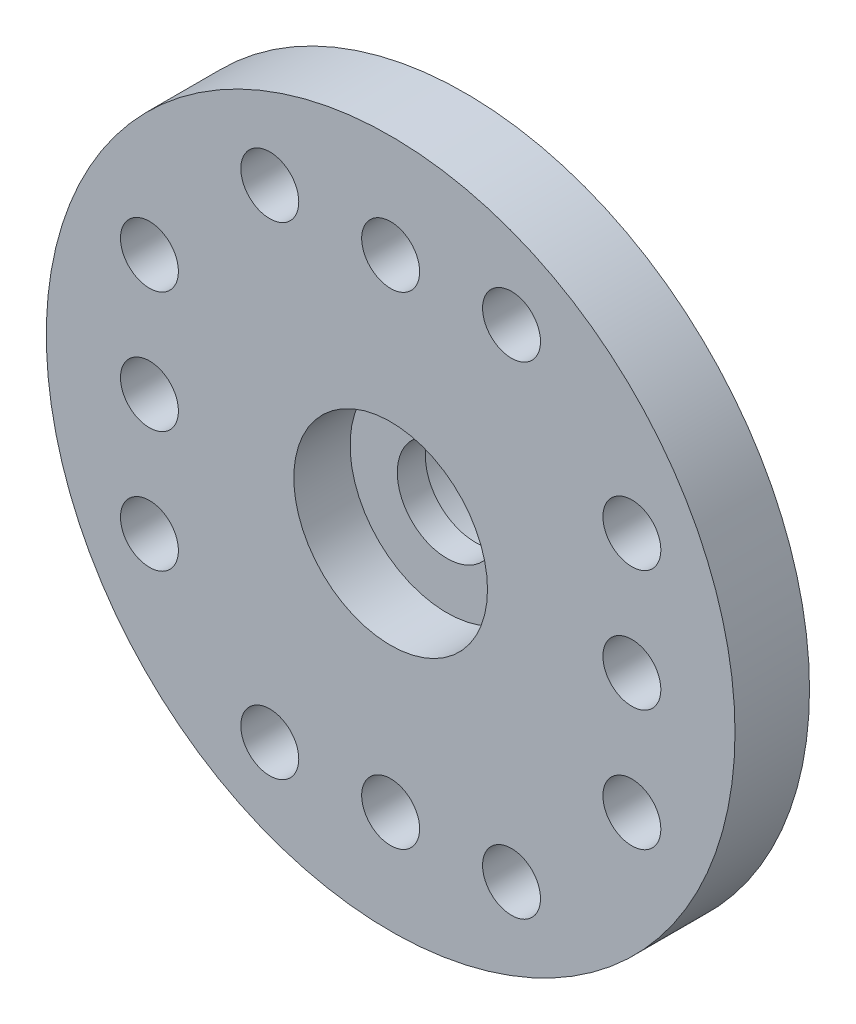
ISO-10303-21;
HEADER;
FILE_DESCRIPTION(('STEP AP214'),'2;1');
FILE_NAME('part.step','',(''),(''),'','','');
FILE_SCHEMA(('AUTOMOTIVE_DESIGN { 1 0 10303 214 1 1 1 1 }'));
ENDSEC;
DATA;
#1=APPLICATION_CONTEXT('core data for automotive mechanical design processes');
#2=APPLICATION_PROTOCOL_DEFINITION('international standard','automotive_design',2000,#1);
#3=PRODUCT_CONTEXT('',#1,'mechanical');
#4=PRODUCT('Part','Part','',(#3));
#5=PRODUCT_RELATED_PRODUCT_CATEGORY('part','',(#4));
#6=PRODUCT_DEFINITION_FORMATION('','',#4);
#7=PRODUCT_DEFINITION_CONTEXT('part definition',#1,'design');
#8=PRODUCT_DEFINITION('design','',#6,#7);
#9=PRODUCT_DEFINITION_SHAPE('','',#8);
#10=(LENGTH_UNIT() NAMED_UNIT(*) SI_UNIT(.MILLI.,.METRE.));
#11=(NAMED_UNIT(*) PLANE_ANGLE_UNIT() SI_UNIT($,.RADIAN.));
#12=(NAMED_UNIT(*) SI_UNIT($,.STERADIAN.) SOLID_ANGLE_UNIT());
#13=UNCERTAINTY_MEASURE_WITH_UNIT(LENGTH_MEASURE(1.E-05),#10,'distance_accuracy_value','');
#14=(GEOMETRIC_REPRESENTATION_CONTEXT(3) GLOBAL_UNCERTAINTY_ASSIGNED_CONTEXT((#13)) GLOBAL_UNIT_ASSIGNED_CONTEXT((#10,
#11,#12)) REPRESENTATION_CONTEXT('',''));
#15=CARTESIAN_POINT('',(0.,0.,0.));
#16=DIRECTION('',(0.,0.,1.));
#17=DIRECTION('',(1.,0.,0.));
#18=AXIS2_PLACEMENT_3D('',#15,#16,#17);
#19=CARTESIAN_POINT('',(9.62,10.,-7.54264068711929));
#20=DIRECTION('',(0.,0.,1.));
#21=DIRECTION('',(1.,0.,0.));
#22=AXIS2_PLACEMENT_3D('',#19,#20,#21);
#23=CYLINDRICAL_SURFACE('',#22,1.5);
#24=CARTESIAN_POINT('',(9.62,10.,0.55));
#25=DIRECTION('',(0.,0.,1.));
#26=DIRECTION('',(1.,0.,0.));
#27=AXIS2_PLACEMENT_3D('',#24,#25,#26);
#28=CIRCLE('',#27,1.5);
#29=CARTESIAN_POINT('',(11.12,10.,0.55));
#30=VERTEX_POINT('',#29);
#31=EDGE_CURVE('E91',#30,#30,#28,.F.);
#32=ORIENTED_EDGE('',*,*,#31,.F.);
#33=EDGE_LOOP('',(#32));
#34=FACE_BOUND('',#33,.T.);
#35=CARTESIAN_POINT('',(9.62,10.,-0.3));
#36=DIRECTION('',(0.,0.,-1.));
#37=DIRECTION('',(-1.,0.,0.));
#38=AXIS2_PLACEMENT_3D('',#35,#36,#37);
#39=CIRCLE('',#38,1.5);
#40=CARTESIAN_POINT('',(8.12,10.,-0.3));
#41=VERTEX_POINT('',#40);
#42=EDGE_CURVE('E38',#41,#41,#39,.F.);
#43=ORIENTED_EDGE('',*,*,#42,.F.);
#44=EDGE_LOOP('',(#43));
#45=FACE_BOUND('',#44,.T.);
#46=ADVANCED_FACE('F34',(#34,#45),#23,.F.);
#47=CARTESIAN_POINT('',(9.62,10.,2.25));
#48=DIRECTION('',(0.,0.,-1.));
#49=DIRECTION('',(-1.,0.,0.));
#50=AXIS2_PLACEMENT_3D('',#47,#48,#49);
#51=CYLINDRICAL_SURFACE('',#50,10.4);
#52=CARTESIAN_POINT('',(9.62,10.,2.25));
#53=DIRECTION('',(0.,0.,1.));
#54=DIRECTION('',(1.,0.,0.));
#55=AXIS2_PLACEMENT_3D('',#52,#53,#54);
#56=CIRCLE('',#55,10.4);
#57=CARTESIAN_POINT('',(20.02,10.,2.25));
#58=VERTEX_POINT('',#57);
#59=EDGE_CURVE('E42',#58,#58,#56,.T.);
#60=ORIENTED_EDGE('',*,*,#59,.F.);
#61=EDGE_LOOP('',(#60));
#62=FACE_BOUND('',#61,.T.);
#63=CARTESIAN_POINT('',(9.62,10.,0.));
#64=DIRECTION('',(0.,0.,1.));
#65=DIRECTION('',(1.,0.,0.));
#66=AXIS2_PLACEMENT_3D('',#63,#64,#65);
#67=CIRCLE('',#66,10.4);
#68=CARTESIAN_POINT('',(20.02,10.,0.));
#69=VERTEX_POINT('',#68);
#70=EDGE_CURVE('E47',#69,#69,#67,.T.);
#71=ORIENTED_EDGE('',*,*,#70,.T.);
#72=EDGE_LOOP('',(#71));
#73=FACE_BOUND('',#72,.T.);
#74=ADVANCED_FACE('F36',(#62,#73),#51,.T.);
#75=CARTESIAN_POINT('',(9.62,10.,2.25));
#76=DIRECTION('',(0.,0.,1.));
#77=DIRECTION('',(1.,0.,0.));
#78=AXIS2_PLACEMENT_3D('',#75,#76,#77);
#79=PLANE('',#78);
#80=CARTESIAN_POINT('',(9.62,10.,2.25));
#81=DIRECTION('',(0.,0.,1.));
#82=DIRECTION('',(1.,0.,0.));
#83=AXIS2_PLACEMENT_3D('',#80,#81,#82);
#84=CIRCLE('',#83,2.925);
#85=CARTESIAN_POINT('',(12.545,10.,2.25));
#86=VERTEX_POINT('',#85);
#87=EDGE_CURVE('E101',#86,#86,#84,.T.);
#88=ORIENTED_EDGE('',*,*,#87,.F.);
#89=EDGE_LOOP('',(#88));
#90=FACE_BOUND('',#89,.T.);
#91=CARTESIAN_POINT('',(13.27,17.285,2.25));
#92=DIRECTION('',(0.,0.,1.));
#93=DIRECTION('',(1.,0.,0.));
#94=AXIS2_PLACEMENT_3D('',#91,#92,#93);
#95=CIRCLE('',#94,0.875);
#96=CARTESIAN_POINT('',(14.145,17.285,2.25));
#97=VERTEX_POINT('',#96);
#98=EDGE_CURVE('E117',#97,#97,#95,.T.);
#99=ORIENTED_EDGE('',*,*,#98,.F.);
#100=EDGE_LOOP('',(#99));
#101=FACE_BOUND('',#100,.T.);
#102=CARTESIAN_POINT('',(9.62,17.285,2.25));
#103=DIRECTION('',(0.,0.,1.));
#104=DIRECTION('',(1.,0.,0.));
#105=AXIS2_PLACEMENT_3D('',#102,#103,#104);
#106=CIRCLE('',#105,0.875);
#107=CARTESIAN_POINT('',(10.495,17.285,2.25));
#108=VERTEX_POINT('',#107);
#109=EDGE_CURVE('E127',#108,#108,#106,.T.);
#110=ORIENTED_EDGE('',*,*,#109,.F.);
#111=EDGE_LOOP('',(#110));
#112=FACE_BOUND('',#111,.T.);
#113=CARTESIAN_POINT('',(2.335,6.35,2.25));
#114=DIRECTION('',(0.,0.,1.));
#115=DIRECTION('',(1.,0.,0.));
#116=AXIS2_PLACEMENT_3D('',#113,#114,#115);
#117=CIRCLE('',#116,0.875000000000001);
#118=CARTESIAN_POINT('',(3.21,6.35,2.25));
#119=VERTEX_POINT('',#118);
#120=EDGE_CURVE('E124',#119,#119,#117,.T.);
#121=ORIENTED_EDGE('',*,*,#120,.F.);
#122=EDGE_LOOP('',(#121));
#123=FACE_BOUND('',#122,.T.);
#124=CARTESIAN_POINT('',(2.335,13.65,2.25));
#125=DIRECTION('',(0.,0.,1.));
#126=DIRECTION('',(1.,0.,0.));
#127=AXIS2_PLACEMENT_3D('',#124,#125,#126);
#128=CIRCLE('',#127,0.874999999999998);
#129=CARTESIAN_POINT('',(3.21,13.65,2.25));
#130=VERTEX_POINT('',#129);
#131=EDGE_CURVE('E120',#130,#130,#128,.T.);
#132=ORIENTED_EDGE('',*,*,#131,.F.);
#133=EDGE_LOOP('',(#132));
#134=FACE_BOUND('',#133,.T.);
#135=CARTESIAN_POINT('',(9.62,2.715,2.25));
#136=DIRECTION('',(0.,0.,1.));
#137=DIRECTION('',(1.,0.,0.));
#138=AXIS2_PLACEMENT_3D('',#135,#136,#137);
#139=CIRCLE('',#138,0.875);
#140=CARTESIAN_POINT('',(10.495,2.715,2.25));
#141=VERTEX_POINT('',#140);
#142=EDGE_CURVE('E59',#141,#141,#139,.T.);
#143=ORIENTED_EDGE('',*,*,#142,.F.);
#144=EDGE_LOOP('',(#143));
#145=FACE_BOUND('',#144,.T.);
#146=CARTESIAN_POINT('',(5.97,2.715,2.25));
#147=DIRECTION('',(0.,0.,1.));
#148=DIRECTION('',(1.,0.,0.));
#149=AXIS2_PLACEMENT_3D('',#146,#147,#148);
#150=CIRCLE('',#149,0.875);
#151=CARTESIAN_POINT('',(6.845,2.715,2.25));
#152=VERTEX_POINT('',#151);
#153=EDGE_CURVE('E135',#152,#152,#150,.T.);
#154=ORIENTED_EDGE('',*,*,#153,.F.);
#155=EDGE_LOOP('',(#154));
#156=FACE_BOUND('',#155,.T.);
#157=CARTESIAN_POINT('',(13.27,2.715,2.25));
#158=DIRECTION('',(0.,0.,1.));
#159=DIRECTION('',(1.,0.,0.));
#160=AXIS2_PLACEMENT_3D('',#157,#158,#159);
#161=CIRCLE('',#160,0.875);
#162=CARTESIAN_POINT('',(14.145,2.715,2.25));
#163=VERTEX_POINT('',#162);
#164=EDGE_CURVE('E132',#163,#163,#161,.T.);
#165=ORIENTED_EDGE('',*,*,#164,.F.);
#166=EDGE_LOOP('',(#165));
#167=FACE_BOUND('',#166,.T.);
#168=CARTESIAN_POINT('',(2.335,10.,2.25));
#169=DIRECTION('',(0.,0.,1.));
#170=DIRECTION('',(1.,0.,0.));
#171=AXIS2_PLACEMENT_3D('',#168,#169,#170);
#172=CIRCLE('',#171,0.875000000000001);
#173=CARTESIAN_POINT('',(3.21,10.,2.25));
#174=VERTEX_POINT('',#173);
#175=EDGE_CURVE('E123',#174,#174,#172,.T.);
#176=ORIENTED_EDGE('',*,*,#175,.F.);
#177=EDGE_LOOP('',(#176));
#178=FACE_BOUND('',#177,.T.);
#179=CARTESIAN_POINT('',(16.905,13.65,2.25));
#180=DIRECTION('',(0.,0.,1.));
#181=DIRECTION('',(1.,0.,0.));
#182=AXIS2_PLACEMENT_3D('',#179,#180,#181);
#183=CIRCLE('',#182,0.875000000000002);
#184=CARTESIAN_POINT('',(17.78,13.65,2.25));
#185=VERTEX_POINT('',#184);
#186=EDGE_CURVE('E93',#185,#185,#183,.T.);
#187=ORIENTED_EDGE('',*,*,#186,.F.);
#188=EDGE_LOOP('',(#187));
#189=FACE_BOUND('',#188,.T.);
#190=CARTESIAN_POINT('',(16.905,6.35,2.25));
#191=DIRECTION('',(0.,0.,1.));
#192=DIRECTION('',(1.,0.,0.));
#193=AXIS2_PLACEMENT_3D('',#190,#191,#192);
#194=CIRCLE('',#193,0.875000000000002);
#195=CARTESIAN_POINT('',(17.78,6.35,2.25));
#196=VERTEX_POINT('',#195);
#197=EDGE_CURVE('E98',#196,#196,#194,.T.);
#198=ORIENTED_EDGE('',*,*,#197,.F.);
#199=EDGE_LOOP('',(#198));
#200=FACE_BOUND('',#199,.T.);
#201=CARTESIAN_POINT('',(16.905,10.,2.25));
#202=DIRECTION('',(0.,0.,1.));
#203=DIRECTION('',(1.,0.,0.));
#204=AXIS2_PLACEMENT_3D('',#201,#202,#203);
#205=CIRCLE('',#204,0.875000000000002);
#206=CARTESIAN_POINT('',(17.78,10.,2.25));
#207=VERTEX_POINT('',#206);
#208=EDGE_CURVE('E112',#207,#207,#205,.T.);
#209=ORIENTED_EDGE('',*,*,#208,.F.);
#210=EDGE_LOOP('',(#209));
#211=FACE_BOUND('',#210,.T.);
#212=CARTESIAN_POINT('',(5.97,17.285,2.25));
#213=DIRECTION('',(0.,0.,1.));
#214=DIRECTION('',(1.,0.,0.));
#215=AXIS2_PLACEMENT_3D('',#212,#213,#214);
#216=CIRCLE('',#215,0.875);
#217=CARTESIAN_POINT('',(6.845,17.285,2.25));
#218=VERTEX_POINT('',#217);
#219=EDGE_CURVE('E114',#218,#218,#216,.T.);
#220=ORIENTED_EDGE('',*,*,#219,.F.);
#221=EDGE_LOOP('',(#220));
#222=FACE_BOUND('',#221,.T.);
#223=ORIENTED_EDGE('',*,*,#59,.T.);
#224=EDGE_LOOP('',(#223));
#225=FACE_BOUND('',#224,.T.);
#226=ADVANCED_FACE('F145',(#90,#101,#112,#123,#134,#145,#156,#167,#178,#189,#200,#211,#222,
#225),#79,.T.);
#227=CARTESIAN_POINT('',(9.62,10.,0.));
#228=DIRECTION('',(0.,0.,1.));
#229=DIRECTION('',(1.,0.,0.));
#230=AXIS2_PLACEMENT_3D('',#227,#228,#229);
#231=PLANE('',#230);
#232=CARTESIAN_POINT('',(13.27,17.285,0.));
#233=DIRECTION('',(0.,0.,1.));
#234=DIRECTION('',(1.,0.,0.));
#235=AXIS2_PLACEMENT_3D('',#232,#233,#234);
#236=CIRCLE('',#235,0.875);
#237=CARTESIAN_POINT('',(14.145,17.285,0.));
#238=VERTEX_POINT('',#237);
#239=EDGE_CURVE('E89',#238,#238,#236,.T.);
#240=ORIENTED_EDGE('',*,*,#239,.T.);
#241=EDGE_LOOP('',(#240));
#242=FACE_BOUND('',#241,.T.);
#243=CARTESIAN_POINT('',(9.62,17.285,0.));
#244=DIRECTION('',(0.,0.,1.));
#245=DIRECTION('',(1.,0.,0.));
#246=AXIS2_PLACEMENT_3D('',#243,#244,#245);
#247=CIRCLE('',#246,0.875);
#248=CARTESIAN_POINT('',(10.495,17.285,0.));
#249=VERTEX_POINT('',#248);
#250=EDGE_CURVE('E86',#249,#249,#247,.T.);
#251=ORIENTED_EDGE('',*,*,#250,.T.);
#252=EDGE_LOOP('',(#251));
#253=FACE_BOUND('',#252,.T.);
#254=CARTESIAN_POINT('',(2.335,6.35,0.));
#255=DIRECTION('',(0.,0.,1.));
#256=DIRECTION('',(1.,0.,0.));
#257=AXIS2_PLACEMENT_3D('',#254,#255,#256);
#258=CIRCLE('',#257,0.875000000000001);
#259=CARTESIAN_POINT('',(3.21,6.35,0.));
#260=VERTEX_POINT('',#259);
#261=EDGE_CURVE('E83',#260,#260,#258,.T.);
#262=ORIENTED_EDGE('',*,*,#261,.T.);
#263=EDGE_LOOP('',(#262));
#264=FACE_BOUND('',#263,.T.);
#265=CARTESIAN_POINT('',(2.335,13.65,0.));
#266=DIRECTION('',(0.,0.,1.));
#267=DIRECTION('',(1.,0.,0.));
#268=AXIS2_PLACEMENT_3D('',#265,#266,#267);
#269=CIRCLE('',#268,0.874999999999998);
#270=CARTESIAN_POINT('',(3.21,13.65,0.));
#271=VERTEX_POINT('',#270);
#272=EDGE_CURVE('E80',#271,#271,#269,.T.);
#273=ORIENTED_EDGE('',*,*,#272,.T.);
#274=EDGE_LOOP('',(#273));
#275=FACE_BOUND('',#274,.T.);
#276=CARTESIAN_POINT('',(9.62,2.715,0.));
#277=DIRECTION('',(0.,0.,1.));
#278=DIRECTION('',(1.,0.,0.));
#279=AXIS2_PLACEMENT_3D('',#276,#277,#278);
#280=CIRCLE('',#279,0.875);
#281=CARTESIAN_POINT('',(10.495,2.715,0.));
#282=VERTEX_POINT('',#281);
#283=EDGE_CURVE('E77',#282,#282,#280,.T.);
#284=ORIENTED_EDGE('',*,*,#283,.T.);
#285=EDGE_LOOP('',(#284));
#286=FACE_BOUND('',#285,.T.);
#287=CARTESIAN_POINT('',(5.97,2.715,0.));
#288=DIRECTION('',(0.,0.,1.));
#289=DIRECTION('',(1.,0.,0.));
#290=AXIS2_PLACEMENT_3D('',#287,#288,#289);
#291=CIRCLE('',#290,0.875);
#292=CARTESIAN_POINT('',(6.845,2.715,0.));
#293=VERTEX_POINT('',#292);
#294=EDGE_CURVE('E74',#293,#293,#291,.T.);
#295=ORIENTED_EDGE('',*,*,#294,.T.);
#296=EDGE_LOOP('',(#295));
#297=FACE_BOUND('',#296,.T.);
#298=CARTESIAN_POINT('',(13.27,2.715,0.));
#299=DIRECTION('',(0.,0.,1.));
#300=DIRECTION('',(1.,0.,0.));
#301=AXIS2_PLACEMENT_3D('',#298,#299,#300);
#302=CIRCLE('',#301,0.875);
#303=CARTESIAN_POINT('',(14.145,2.715,0.));
#304=VERTEX_POINT('',#303);
#305=EDGE_CURVE('E71',#304,#304,#302,.T.);
#306=ORIENTED_EDGE('',*,*,#305,.T.);
#307=EDGE_LOOP('',(#306));
#308=FACE_BOUND('',#307,.T.);
#309=CARTESIAN_POINT('',(2.335,10.,0.));
#310=DIRECTION('',(0.,0.,1.));
#311=DIRECTION('',(1.,0.,0.));
#312=AXIS2_PLACEMENT_3D('',#309,#310,#311);
#313=CIRCLE('',#312,0.875000000000001);
#314=CARTESIAN_POINT('',(3.21,10.,0.));
#315=VERTEX_POINT('',#314);
#316=EDGE_CURVE('E68',#315,#315,#313,.T.);
#317=ORIENTED_EDGE('',*,*,#316,.T.);
#318=EDGE_LOOP('',(#317));
#319=FACE_BOUND('',#318,.T.);
#320=CARTESIAN_POINT('',(16.905,13.65,0.));
#321=DIRECTION('',(0.,0.,1.));
#322=DIRECTION('',(1.,0.,0.));
#323=AXIS2_PLACEMENT_3D('',#320,#321,#322);
#324=CIRCLE('',#323,0.875000000000002);
#325=CARTESIAN_POINT('',(17.78,13.65,0.));
#326=VERTEX_POINT('',#325);
#327=EDGE_CURVE('E65',#326,#326,#324,.T.);
#328=ORIENTED_EDGE('',*,*,#327,.T.);
#329=EDGE_LOOP('',(#328));
#330=FACE_BOUND('',#329,.T.);
#331=CARTESIAN_POINT('',(16.905,6.35,0.));
#332=DIRECTION('',(0.,0.,1.));
#333=DIRECTION('',(1.,0.,0.));
#334=AXIS2_PLACEMENT_3D('',#331,#332,#333);
#335=CIRCLE('',#334,0.875000000000002);
#336=CARTESIAN_POINT('',(17.78,6.35,0.));
#337=VERTEX_POINT('',#336);
#338=EDGE_CURVE('E62',#337,#337,#335,.T.);
#339=ORIENTED_EDGE('',*,*,#338,.T.);
#340=EDGE_LOOP('',(#339));
#341=FACE_BOUND('',#340,.T.);
#342=CARTESIAN_POINT('',(16.905,10.,0.));
#343=DIRECTION('',(0.,0.,1.));
#344=DIRECTION('',(1.,0.,0.));
#345=AXIS2_PLACEMENT_3D('',#342,#343,#344);
#346=CIRCLE('',#345,0.875000000000002);
#347=CARTESIAN_POINT('',(17.78,10.,0.));
#348=VERTEX_POINT('',#347);
#349=EDGE_CURVE('E58',#348,#348,#346,.T.);
#350=ORIENTED_EDGE('',*,*,#349,.T.);
#351=EDGE_LOOP('',(#350));
#352=FACE_BOUND('',#351,.T.);
#353=CARTESIAN_POINT('',(5.97,17.285,0.));
#354=DIRECTION('',(0.,0.,1.));
#355=DIRECTION('',(1.,0.,0.));
#356=AXIS2_PLACEMENT_3D('',#353,#354,#355);
#357=CIRCLE('',#356,0.875);
#358=CARTESIAN_POINT('',(6.845,17.285,0.));
#359=VERTEX_POINT('',#358);
#360=EDGE_CURVE('E55',#359,#359,#357,.T.);
#361=ORIENTED_EDGE('',*,*,#360,.T.);
#362=EDGE_LOOP('',(#361));
#363=FACE_BOUND('',#362,.T.);
#364=CARTESIAN_POINT('',(9.62,10.,0.));
#365=DIRECTION('',(0.,0.,-1.));
#366=DIRECTION('',(-1.,0.,0.));
#367=AXIS2_PLACEMENT_3D('',#364,#365,#366);
#368=CIRCLE('',#367,4.4);
#369=CARTESIAN_POINT('',(5.22,10.,0.));
#370=VERTEX_POINT('',#369);
#371=EDGE_CURVE('E10',#370,#370,#368,.T.);
#372=ORIENTED_EDGE('',*,*,#371,.F.);
#373=EDGE_LOOP('',(#372));
#374=FACE_BOUND('',#373,.T.);
#375=ORIENTED_EDGE('',*,*,#70,.F.);
#376=EDGE_LOOP('',(#375));
#377=FACE_BOUND('',#376,.T.);
#378=ADVANCED_FACE('F148',(#242,#253,#264,#275,#286,#297,#308,#319,#330,#341,#352,#363,#374,
#377),#231,.F.);
#379=CARTESIAN_POINT('',(9.62,10.,-3.3));
#380=DIRECTION('',(0.,0.,1.));
#381=DIRECTION('',(1.,0.,0.));
#382=AXIS2_PLACEMENT_3D('',#379,#380,#381);
#383=CYLINDRICAL_SURFACE('',#382,4.4);
#384=CARTESIAN_POINT('',(9.62,10.,-3.3));
#385=DIRECTION('',(0.,0.,-1.));
#386=DIRECTION('',(-1.,0.,0.));
#387=AXIS2_PLACEMENT_3D('',#384,#385,#386);
#388=CIRCLE('',#387,4.4);
#389=CARTESIAN_POINT('',(5.22,10.,-3.3));
#390=VERTEX_POINT('',#389);
#391=EDGE_CURVE('E50',#390,#390,#388,.T.);
#392=ORIENTED_EDGE('',*,*,#391,.F.);
#393=EDGE_LOOP('',(#392));
#394=FACE_BOUND('',#393,.T.);
#395=ORIENTED_EDGE('',*,*,#371,.T.);
#396=EDGE_LOOP('',(#395));
#397=FACE_BOUND('',#396,.T.);
#398=ADVANCED_FACE('F170',(#394,#397),#383,.T.);
#399=CARTESIAN_POINT('',(9.62,10.,-3.3));
#400=DIRECTION('',(0.,0.,-1.));
#401=DIRECTION('',(-1.,0.,0.));
#402=AXIS2_PLACEMENT_3D('',#399,#400,#401);
#403=PLANE('',#402);
#404=CARTESIAN_POINT('',(9.62,10.,-3.3));
#405=DIRECTION('',(0.,0.,-1.));
#406=DIRECTION('',(-1.,0.,0.));
#407=AXIS2_PLACEMENT_3D('',#404,#405,#406);
#408=CIRCLE('',#407,2.95);
#409=CARTESIAN_POINT('',(6.67,10.,-3.3));
#410=VERTEX_POINT('',#409);
#411=EDGE_CURVE('E108',#410,#410,#408,.T.);
#412=ORIENTED_EDGE('',*,*,#411,.F.);
#413=EDGE_LOOP('',(#412));
#414=FACE_BOUND('',#413,.T.);
#415=ORIENTED_EDGE('',*,*,#391,.T.);
#416=EDGE_LOOP('',(#415));
#417=FACE_BOUND('',#416,.T.);
#418=ADVANCED_FACE('F175',(#414,#417),#403,.T.);
#419=CARTESIAN_POINT('',(5.97,17.285,-7.54264068711929));
#420=DIRECTION('',(0.,0.,1.));
#421=DIRECTION('',(1.,0.,0.));
#422=AXIS2_PLACEMENT_3D('',#419,#420,#421);
#423=CYLINDRICAL_SURFACE('',#422,0.875);
#424=ORIENTED_EDGE('',*,*,#219,.T.);
#425=EDGE_LOOP('',(#424));
#426=FACE_BOUND('',#425,.T.);
#427=ORIENTED_EDGE('',*,*,#360,.F.);
#428=EDGE_LOOP('',(#427));
#429=FACE_BOUND('',#428,.T.);
#430=ADVANCED_FACE('F189',(#426,#429),#423,.F.);
#431=CARTESIAN_POINT('',(16.905,10.,-7.54264068711929));
#432=DIRECTION('',(0.,0.,1.));
#433=DIRECTION('',(1.,0.,0.));
#434=AXIS2_PLACEMENT_3D('',#431,#432,#433);
#435=CYLINDRICAL_SURFACE('',#434,0.875000000000002);
#436=ORIENTED_EDGE('',*,*,#208,.T.);
#437=EDGE_LOOP('',(#436));
#438=FACE_BOUND('',#437,.T.);
#439=ORIENTED_EDGE('',*,*,#349,.F.);
#440=EDGE_LOOP('',(#439));
#441=FACE_BOUND('',#440,.T.);
#442=ADVANCED_FACE('F194',(#438,#441),#435,.F.);
#443=CARTESIAN_POINT('',(16.905,6.35,-7.54264068711929));
#444=DIRECTION('',(0.,0.,1.));
#445=DIRECTION('',(1.,0.,0.));
#446=AXIS2_PLACEMENT_3D('',#443,#444,#445);
#447=CYLINDRICAL_SURFACE('',#446,0.875000000000002);
#448=ORIENTED_EDGE('',*,*,#197,.T.);
#449=EDGE_LOOP('',(#448));
#450=FACE_BOUND('',#449,.T.);
#451=ORIENTED_EDGE('',*,*,#338,.F.);
#452=EDGE_LOOP('',(#451));
#453=FACE_BOUND('',#452,.T.);
#454=ADVANCED_FACE('F228',(#450,#453),#447,.F.);
#455=CARTESIAN_POINT('',(16.905,13.65,-7.54264068711929));
#456=DIRECTION('',(0.,0.,1.));
#457=DIRECTION('',(1.,0.,0.));
#458=AXIS2_PLACEMENT_3D('',#455,#456,#457);
#459=CYLINDRICAL_SURFACE('',#458,0.875000000000002);
#460=ORIENTED_EDGE('',*,*,#186,.T.);
#461=EDGE_LOOP('',(#460));
#462=FACE_BOUND('',#461,.T.);
#463=ORIENTED_EDGE('',*,*,#327,.F.);
#464=EDGE_LOOP('',(#463));
#465=FACE_BOUND('',#464,.T.);
#466=ADVANCED_FACE('F231',(#462,#465),#459,.F.);
#467=CARTESIAN_POINT('',(2.335,10.,-7.54264068711929));
#468=DIRECTION('',(0.,0.,1.));
#469=DIRECTION('',(1.,0.,0.));
#470=AXIS2_PLACEMENT_3D('',#467,#468,#469);
#471=CYLINDRICAL_SURFACE('',#470,0.875000000000001);
#472=ORIENTED_EDGE('',*,*,#175,.T.);
#473=EDGE_LOOP('',(#472));
#474=FACE_BOUND('',#473,.T.);
#475=ORIENTED_EDGE('',*,*,#316,.F.);
#476=EDGE_LOOP('',(#475));
#477=FACE_BOUND('',#476,.T.);
#478=ADVANCED_FACE('F234',(#474,#477),#471,.F.);
#479=CARTESIAN_POINT('',(13.27,2.715,-7.54264068711929));
#480=DIRECTION('',(0.,0.,1.));
#481=DIRECTION('',(1.,0.,0.));
#482=AXIS2_PLACEMENT_3D('',#479,#480,#481);
#483=CYLINDRICAL_SURFACE('',#482,0.875);
#484=ORIENTED_EDGE('',*,*,#164,.T.);
#485=EDGE_LOOP('',(#484));
#486=FACE_BOUND('',#485,.T.);
#487=ORIENTED_EDGE('',*,*,#305,.F.);
#488=EDGE_LOOP('',(#487));
#489=FACE_BOUND('',#488,.T.);
#490=ADVANCED_FACE('F256',(#486,#489),#483,.F.);
#491=CARTESIAN_POINT('',(5.97,2.715,-7.54264068711929));
#492=DIRECTION('',(0.,0.,1.));
#493=DIRECTION('',(1.,0.,0.));
#494=AXIS2_PLACEMENT_3D('',#491,#492,#493);
#495=CYLINDRICAL_SURFACE('',#494,0.875);
#496=ORIENTED_EDGE('',*,*,#153,.T.);
#497=EDGE_LOOP('',(#496));
#498=FACE_BOUND('',#497,.T.);
#499=ORIENTED_EDGE('',*,*,#294,.F.);
#500=EDGE_LOOP('',(#499));
#501=FACE_BOUND('',#500,.T.);
#502=ADVANCED_FACE('F142',(#498,#501),#495,.F.);
#503=CARTESIAN_POINT('',(9.62,2.715,-7.54264068711929));
#504=DIRECTION('',(0.,0.,1.));
#505=DIRECTION('',(1.,0.,0.));
#506=AXIS2_PLACEMENT_3D('',#503,#504,#505);
#507=CYLINDRICAL_SURFACE('',#506,0.875);
#508=ORIENTED_EDGE('',*,*,#142,.T.);
#509=EDGE_LOOP('',(#508));
#510=FACE_BOUND('',#509,.T.);
#511=ORIENTED_EDGE('',*,*,#283,.F.);
#512=EDGE_LOOP('',(#511));
#513=FACE_BOUND('',#512,.T.);
#514=ADVANCED_FACE('F244',(#510,#513),#507,.F.);
#515=CARTESIAN_POINT('',(2.335,13.65,-7.54264068711929));
#516=DIRECTION('',(0.,0.,1.));
#517=DIRECTION('',(1.,0.,0.));
#518=AXIS2_PLACEMENT_3D('',#515,#516,#517);
#519=CYLINDRICAL_SURFACE('',#518,0.874999999999998);
#520=ORIENTED_EDGE('',*,*,#131,.T.);
#521=EDGE_LOOP('',(#520));
#522=FACE_BOUND('',#521,.T.);
#523=ORIENTED_EDGE('',*,*,#272,.F.);
#524=EDGE_LOOP('',(#523));
#525=FACE_BOUND('',#524,.T.);
#526=ADVANCED_FACE('F240',(#522,#525),#519,.F.);
#527=CARTESIAN_POINT('',(2.335,6.35,-7.54264068711929));
#528=DIRECTION('',(0.,0.,1.));
#529=DIRECTION('',(1.,0.,0.));
#530=AXIS2_PLACEMENT_3D('',#527,#528,#529);
#531=CYLINDRICAL_SURFACE('',#530,0.875000000000001);
#532=ORIENTED_EDGE('',*,*,#120,.T.);
#533=EDGE_LOOP('',(#532));
#534=FACE_BOUND('',#533,.T.);
#535=ORIENTED_EDGE('',*,*,#261,.F.);
#536=EDGE_LOOP('',(#535));
#537=FACE_BOUND('',#536,.T.);
#538=ADVANCED_FACE('F243',(#534,#537),#531,.F.);
#539=CARTESIAN_POINT('',(9.62,17.285,-7.54264068711929));
#540=DIRECTION('',(0.,0.,1.));
#541=DIRECTION('',(1.,0.,0.));
#542=AXIS2_PLACEMENT_3D('',#539,#540,#541);
#543=CYLINDRICAL_SURFACE('',#542,0.875);
#544=ORIENTED_EDGE('',*,*,#109,.T.);
#545=EDGE_LOOP('',(#544));
#546=FACE_BOUND('',#545,.T.);
#547=ORIENTED_EDGE('',*,*,#250,.F.);
#548=EDGE_LOOP('',(#547));
#549=FACE_BOUND('',#548,.T.);
#550=ADVANCED_FACE('F248',(#546,#549),#543,.F.);
#551=CARTESIAN_POINT('',(13.27,17.285,-7.54264068711929));
#552=DIRECTION('',(0.,0.,1.));
#553=DIRECTION('',(1.,0.,0.));
#554=AXIS2_PLACEMENT_3D('',#551,#552,#553);
#555=CYLINDRICAL_SURFACE('',#554,0.875);
#556=ORIENTED_EDGE('',*,*,#98,.T.);
#557=EDGE_LOOP('',(#556));
#558=FACE_BOUND('',#557,.T.);
#559=ORIENTED_EDGE('',*,*,#239,.F.);
#560=EDGE_LOOP('',(#559));
#561=FACE_BOUND('',#560,.T.);
#562=ADVANCED_FACE('F226',(#558,#561),#555,.F.);
#563=CARTESIAN_POINT('',(9.62,10.,0.55));
#564=DIRECTION('',(0.,0.,1.));
#565=DIRECTION('',(1.,0.,0.));
#566=AXIS2_PLACEMENT_3D('',#563,#564,#565);
#567=PLANE('',#566);
#568=CARTESIAN_POINT('',(9.62,10.,0.55));
#569=DIRECTION('',(0.,0.,1.));
#570=DIRECTION('',(1.,0.,0.));
#571=AXIS2_PLACEMENT_3D('',#568,#569,#570);
#572=CIRCLE('',#571,2.925);
#573=CARTESIAN_POINT('',(12.545,10.,0.55));
#574=VERTEX_POINT('',#573);
#575=EDGE_CURVE('E94',#574,#574,#572,.T.);
#576=ORIENTED_EDGE('',*,*,#575,.T.);
#577=EDGE_LOOP('',(#576));
#578=FACE_BOUND('',#577,.T.);
#579=ORIENTED_EDGE('',*,*,#31,.T.);
#580=EDGE_LOOP('',(#579));
#581=FACE_BOUND('',#580,.T.);
#582=ADVANCED_FACE('F221',(#578,#581),#567,.T.);
#583=CARTESIAN_POINT('',(9.62,10.,0.55));
#584=DIRECTION('',(0.,0.,1.));
#585=DIRECTION('',(1.,0.,0.));
#586=AXIS2_PLACEMENT_3D('',#583,#584,#585);
#587=CYLINDRICAL_SURFACE('',#586,2.925);
#588=ORIENTED_EDGE('',*,*,#575,.F.);
#589=EDGE_LOOP('',(#588));
#590=FACE_BOUND('',#589,.T.);
#591=ORIENTED_EDGE('',*,*,#87,.T.);
#592=EDGE_LOOP('',(#591));
#593=FACE_BOUND('',#592,.T.);
#594=ADVANCED_FACE('F213',(#590,#593),#587,.F.);
#595=CARTESIAN_POINT('',(9.62,10.,-0.3));
#596=DIRECTION('',(0.,0.,-1.));
#597=DIRECTION('',(-1.,0.,0.));
#598=AXIS2_PLACEMENT_3D('',#595,#596,#597);
#599=PLANE('',#598);
#600=CARTESIAN_POINT('',(9.62,10.,-0.3));
#601=DIRECTION('',(0.,0.,-1.));
#602=DIRECTION('',(-1.,0.,0.));
#603=AXIS2_PLACEMENT_3D('',#600,#601,#602);
#604=CIRCLE('',#603,2.95);
#605=CARTESIAN_POINT('',(6.67,10.,-0.3));
#606=VERTEX_POINT('',#605);
#607=EDGE_CURVE('E203',#606,#606,#604,.T.);
#608=ORIENTED_EDGE('',*,*,#607,.T.);
#609=EDGE_LOOP('',(#608));
#610=FACE_BOUND('',#609,.T.);
#611=ORIENTED_EDGE('',*,*,#42,.T.);
#612=EDGE_LOOP('',(#611));
#613=FACE_BOUND('',#612,.T.);
#614=ADVANCED_FACE('F210',(#610,#613),#599,.T.);
#615=CARTESIAN_POINT('',(9.62,10.,-0.3));
#616=DIRECTION('',(0.,0.,-1.));
#617=DIRECTION('',(-1.,0.,0.));
#618=AXIS2_PLACEMENT_3D('',#615,#616,#617);
#619=CYLINDRICAL_SURFACE('',#618,2.95);
#620=ORIENTED_EDGE('',*,*,#607,.F.);
#621=EDGE_LOOP('',(#620));
#622=FACE_BOUND('',#621,.T.);
#623=ORIENTED_EDGE('',*,*,#411,.T.);
#624=EDGE_LOOP('',(#623));
#625=FACE_BOUND('',#624,.T.);
#626=ADVANCED_FACE('F212',(#622,#625),#619,.F.);
#627=CLOSED_SHELL('',(#46,#74,#226,#378,#398,#418,#430,#442,#454,#466,#478,#490,#502,#514,#526,
#538,#550,#562,#582,#594,#614,#626));
#628=MANIFOLD_SOLID_BREP('B2',#627);
#629=ADVANCED_BREP_SHAPE_REPRESENTATION('',(#18,#628),#14);
#630=SHAPE_DEFINITION_REPRESENTATION(#9,#629);
ENDSEC;
END-ISO-10303-21;
